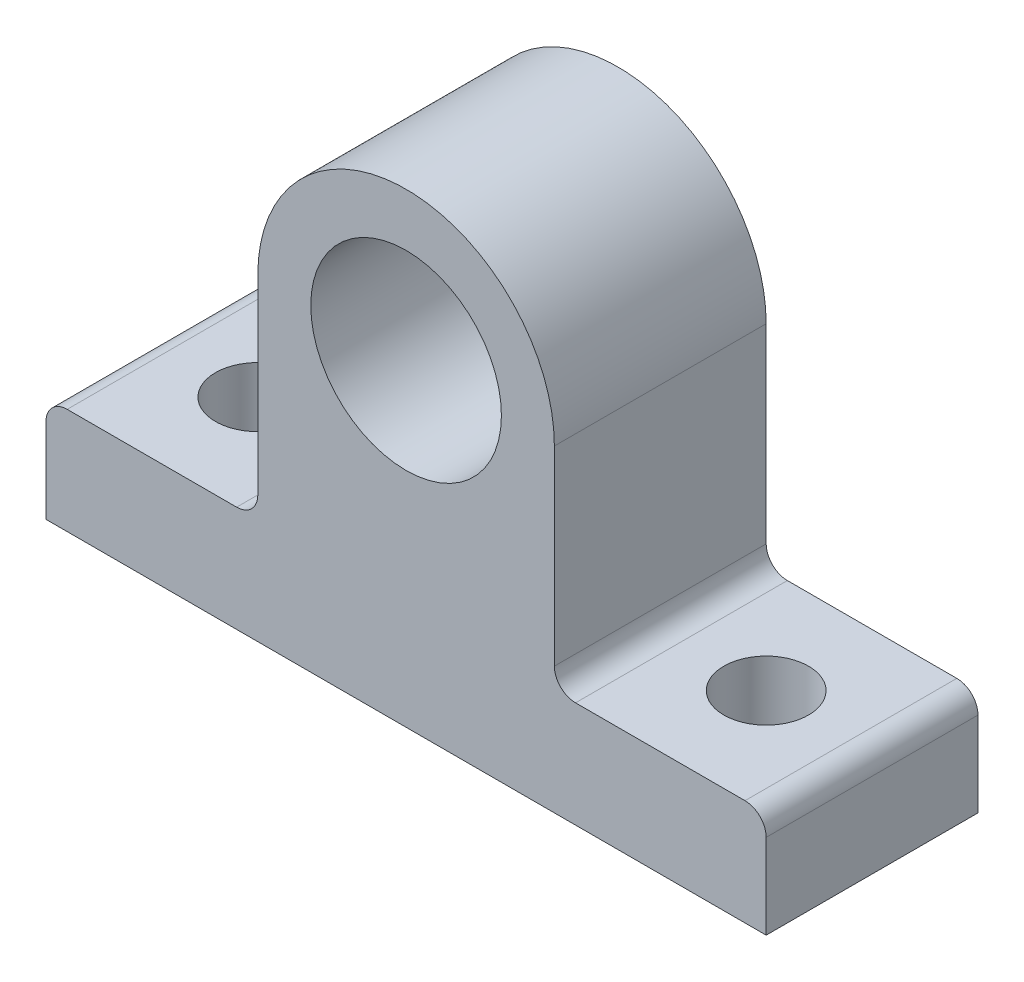
ISO-10303-21;
HEADER;
FILE_DESCRIPTION(('STEP AP214'),'2;1');
FILE_NAME('part.step','',(''),(''),'','','');
FILE_SCHEMA(('AUTOMOTIVE_DESIGN { 1 0 10303 214 1 1 1 1 }'));
ENDSEC;
DATA;
#1=APPLICATION_CONTEXT('core data for automotive mechanical design processes');
#2=APPLICATION_PROTOCOL_DEFINITION('international standard','automotive_design',2000,#1);
#3=PRODUCT_CONTEXT('',#1,'mechanical');
#4=PRODUCT('Part','Part','',(#3));
#5=PRODUCT_RELATED_PRODUCT_CATEGORY('part','',(#4));
#6=PRODUCT_DEFINITION_FORMATION('','',#4);
#7=PRODUCT_DEFINITION_CONTEXT('part definition',#1,'design');
#8=PRODUCT_DEFINITION('design','',#6,#7);
#9=PRODUCT_DEFINITION_SHAPE('','',#8);
#10=(LENGTH_UNIT() NAMED_UNIT(*) SI_UNIT(.MILLI.,.METRE.));
#11=(NAMED_UNIT(*) PLANE_ANGLE_UNIT() SI_UNIT($,.RADIAN.));
#12=(NAMED_UNIT(*) SI_UNIT($,.STERADIAN.) SOLID_ANGLE_UNIT());
#13=UNCERTAINTY_MEASURE_WITH_UNIT(LENGTH_MEASURE(1.E-05),#10,'distance_accuracy_value','');
#14=(GEOMETRIC_REPRESENTATION_CONTEXT(3) GLOBAL_UNCERTAINTY_ASSIGNED_CONTEXT((#13)) GLOBAL_UNIT_ASSIGNED_CONTEXT((#10,
#11,#12)) REPRESENTATION_CONTEXT('',''));
#15=CARTESIAN_POINT('',(0.,0.,0.));
#16=DIRECTION('',(0.,0.,1.));
#17=DIRECTION('',(1.,0.,0.));
#18=AXIS2_PLACEMENT_3D('',#15,#16,#17);
#19=CARTESIAN_POINT('',(17.,0.,10.));
#20=DIRECTION('',(-1.,0.,0.));
#21=DIRECTION('',(0.,-1.,0.));
#22=AXIS2_PLACEMENT_3D('',#19,#20,#21);
#23=PLANE('',#22);
#24=DIRECTION('',(0.,1.,0.));
#25=VECTOR('',#24,1.);
#26=CARTESIAN_POINT('',(17.,0.,0.));
#27=LINE('',#26,#25);
#28=CARTESIAN_POINT('',(17.,-15.,0.));
#29=VERTEX_POINT('',#28);
#30=CARTESIAN_POINT('',(17.,-11.,0.));
#31=VERTEX_POINT('',#30);
#32=EDGE_CURVE('E175',#29,#31,#27,.T.);
#33=ORIENTED_EDGE('',*,*,#32,.T.);
#34=DIRECTION('',(0.,0.,-1.));
#35=VECTOR('',#34,1.);
#36=CARTESIAN_POINT('',(17.,-11.,10.));
#37=LINE('',#36,#35);
#38=CARTESIAN_POINT('',(17.,-11.,10.));
#39=VERTEX_POINT('',#38);
#40=EDGE_CURVE('E60',#31,#39,#37,.F.);
#41=ORIENTED_EDGE('',*,*,#40,.T.);
#42=DIRECTION('',(0.,1.,0.));
#43=VECTOR('',#42,1.);
#44=CARTESIAN_POINT('',(17.,0.,10.));
#45=LINE('',#44,#43);
#46=CARTESIAN_POINT('',(17.,-15.,10.));
#47=VERTEX_POINT('',#46);
#48=EDGE_CURVE('E159',#47,#39,#45,.T.);
#49=ORIENTED_EDGE('',*,*,#48,.F.);
#50=DIRECTION('',(0.,0.,-1.));
#51=VECTOR('',#50,1.);
#52=CARTESIAN_POINT('',(17.,-15.,10.));
#53=LINE('',#52,#51);
#54=EDGE_CURVE('E174',#47,#29,#53,.T.);
#55=ORIENTED_EDGE('',*,*,#54,.T.);
#56=EDGE_LOOP('',(#33,#41,#49,#55));
#57=FACE_BOUND('',#56,.T.);
#58=ADVANCED_FACE('F37',(#57),#23,.F.);
#59=CARTESIAN_POINT('',(0.,-10.,10.));
#60=DIRECTION('',(0.,-1.,0.));
#61=DIRECTION('',(0.,0.,-1.));
#62=AXIS2_PLACEMENT_3D('',#59,#60,#61);
#63=PLANE('',#62);
#64=CARTESIAN_POINT('',(12.,-10.,5.));
#65=DIRECTION('',(0.,1.,0.));
#66=DIRECTION('',(0.,0.,1.));
#67=AXIS2_PLACEMENT_3D('',#64,#65,#66);
#68=CIRCLE('',#67,2.);
#69=CARTESIAN_POINT('',(12.,-10.,7.));
#70=VERTEX_POINT('',#69);
#71=EDGE_CURVE('E259',#70,#70,#68,.T.);
#72=ORIENTED_EDGE('',*,*,#71,.F.);
#73=EDGE_LOOP('',(#72));
#74=FACE_BOUND('',#73,.T.);
#75=DIRECTION('',(-1.,0.,0.));
#76=VECTOR('',#75,1.);
#77=CARTESIAN_POINT('',(0.,-10.,0.));
#78=LINE('',#77,#76);
#79=CARTESIAN_POINT('',(16.,-10.,0.));
#80=VERTEX_POINT('',#79);
#81=CARTESIAN_POINT('',(8.,-10.,0.));
#82=VERTEX_POINT('',#81);
#83=EDGE_CURVE('E177',#80,#82,#78,.T.);
#84=ORIENTED_EDGE('',*,*,#83,.T.);
#85=DIRECTION('',(0.,0.,-1.));
#86=VECTOR('',#85,1.);
#87=CARTESIAN_POINT('',(8.,-10.,10.));
#88=LINE('',#87,#86);
#89=CARTESIAN_POINT('',(8.,-10.,10.));
#90=VERTEX_POINT('',#89);
#91=EDGE_CURVE('E206',#82,#90,#88,.F.);
#92=ORIENTED_EDGE('',*,*,#91,.T.);
#93=DIRECTION('',(-1.,0.,0.));
#94=VECTOR('',#93,1.);
#95=CARTESIAN_POINT('',(0.,-10.,10.));
#96=LINE('',#95,#94);
#97=CARTESIAN_POINT('',(16.,-10.,10.));
#98=VERTEX_POINT('',#97);
#99=EDGE_CURVE('E157',#98,#90,#96,.T.);
#100=ORIENTED_EDGE('',*,*,#99,.F.);
#101=DIRECTION('',(0.,0.,-1.));
#102=VECTOR('',#101,1.);
#103=CARTESIAN_POINT('',(16.,-10.,10.));
#104=LINE('',#103,#102);
#105=EDGE_CURVE('E203',#98,#80,#104,.T.);
#106=ORIENTED_EDGE('',*,*,#105,.T.);
#107=EDGE_LOOP('',(#84,#92,#100,#106));
#108=FACE_BOUND('',#107,.T.);
#109=ADVANCED_FACE('F281',(#74,#108),#63,.F.);
#110=CARTESIAN_POINT('',(7.,0.,10.));
#111=DIRECTION('',(1.,0.,0.));
#112=DIRECTION('',(0.,1.,0.));
#113=AXIS2_PLACEMENT_3D('',#110,#111,#112);
#114=PLANE('',#113);
#115=DIRECTION('',(0.,-1.,0.));
#116=VECTOR('',#115,1.);
#117=CARTESIAN_POINT('',(7.,0.,10.));
#118=LINE('',#117,#116);
#119=CARTESIAN_POINT('',(7.,0.,10.));
#120=VERTEX_POINT('',#119);
#121=CARTESIAN_POINT('',(7.,-9.,10.));
#122=VERTEX_POINT('',#121);
#123=EDGE_CURVE('E134',#120,#122,#118,.T.);
#124=ORIENTED_EDGE('',*,*,#123,.T.);
#125=DIRECTION('',(0.,0.,-1.));
#126=VECTOR('',#125,1.);
#127=CARTESIAN_POINT('',(7.,-9.,10.));
#128=LINE('',#127,#126);
#129=CARTESIAN_POINT('',(7.,-9.,0.));
#130=VERTEX_POINT('',#129);
#131=EDGE_CURVE('E141',#122,#130,#128,.T.);
#132=ORIENTED_EDGE('',*,*,#131,.T.);
#133=DIRECTION('',(0.,-1.,0.));
#134=VECTOR('',#133,1.);
#135=CARTESIAN_POINT('',(7.,0.,0.));
#136=LINE('',#135,#134);
#137=CARTESIAN_POINT('',(7.,0.,0.));
#138=VERTEX_POINT('',#137);
#139=EDGE_CURVE('E137',#138,#130,#136,.T.);
#140=ORIENTED_EDGE('',*,*,#139,.F.);
#141=DIRECTION('',(0.,0.,-1.));
#142=VECTOR('',#141,1.);
#143=CARTESIAN_POINT('',(7.,0.,10.));
#144=LINE('',#143,#142);
#145=EDGE_CURVE('E129',#120,#138,#144,.T.);
#146=ORIENTED_EDGE('',*,*,#145,.F.);
#147=EDGE_LOOP('',(#124,#132,#140,#146));
#148=FACE_BOUND('',#147,.T.);
#149=ADVANCED_FACE('F131',(#148),#114,.T.);
#150=CARTESIAN_POINT('',(0.,0.,10.));
#151=DIRECTION('',(0.,0.,-1.));
#152=DIRECTION('',(-1.,0.,0.));
#153=AXIS2_PLACEMENT_3D('',#150,#151,#152);
#154=CYLINDRICAL_SURFACE('',#153,7.);
#155=CARTESIAN_POINT('',(0.,0.,0.));
#156=DIRECTION('',(0.,0.,1.));
#157=DIRECTION('',(1.,0.,0.));
#158=AXIS2_PLACEMENT_3D('',#155,#156,#157);
#159=CIRCLE('',#158,7.);
#160=CARTESIAN_POINT('',(-7.,0.,0.));
#161=VERTEX_POINT('',#160);
#162=EDGE_CURVE('E182',#138,#161,#159,.T.);
#163=ORIENTED_EDGE('',*,*,#162,.T.);
#164=DIRECTION('',(0.,0.,-1.));
#165=VECTOR('',#164,1.);
#166=CARTESIAN_POINT('',(-7.,0.,10.));
#167=LINE('',#166,#165);
#168=CARTESIAN_POINT('',(-7.,0.,10.));
#169=VERTEX_POINT('',#168);
#170=EDGE_CURVE('E142',#169,#161,#167,.T.);
#171=ORIENTED_EDGE('',*,*,#170,.F.);
#172=CARTESIAN_POINT('',(0.,0.,10.));
#173=DIRECTION('',(0.,0.,1.));
#174=DIRECTION('',(1.,0.,0.));
#175=AXIS2_PLACEMENT_3D('',#172,#173,#174);
#176=CIRCLE('',#175,7.);
#177=EDGE_CURVE('E146',#120,#169,#176,.T.);
#178=ORIENTED_EDGE('',*,*,#177,.F.);
#179=ORIENTED_EDGE('',*,*,#145,.T.);
#180=EDGE_LOOP('',(#163,#171,#178,#179));
#181=FACE_BOUND('',#180,.T.);
#182=ADVANCED_FACE('F147',(#181),#154,.T.);
#183=CARTESIAN_POINT('',(-7.,0.,10.));
#184=DIRECTION('',(-1.,0.,0.));
#185=DIRECTION('',(0.,-1.,0.));
#186=AXIS2_PLACEMENT_3D('',#183,#184,#185);
#187=PLANE('',#186);
#188=DIRECTION('',(0.,1.,0.));
#189=VECTOR('',#188,1.);
#190=CARTESIAN_POINT('',(-7.,0.,0.));
#191=LINE('',#190,#189);
#192=CARTESIAN_POINT('',(-7.,-9.,0.));
#193=VERTEX_POINT('',#192);
#194=EDGE_CURVE('E184',#193,#161,#191,.T.);
#195=ORIENTED_EDGE('',*,*,#194,.F.);
#196=DIRECTION('',(0.,0.,-1.));
#197=VECTOR('',#196,1.);
#198=CARTESIAN_POINT('',(-7.,-9.,10.));
#199=LINE('',#198,#197);
#200=CARTESIAN_POINT('',(-7.,-9.,10.));
#201=VERTEX_POINT('',#200);
#202=EDGE_CURVE('E213',#193,#201,#199,.F.);
#203=ORIENTED_EDGE('',*,*,#202,.T.);
#204=DIRECTION('',(0.,1.,0.));
#205=VECTOR('',#204,1.);
#206=CARTESIAN_POINT('',(-7.,0.,10.));
#207=LINE('',#206,#205);
#208=EDGE_CURVE('E150',#201,#169,#207,.T.);
#209=ORIENTED_EDGE('',*,*,#208,.T.);
#210=ORIENTED_EDGE('',*,*,#170,.T.);
#211=EDGE_LOOP('',(#195,#203,#209,#210));
#212=FACE_BOUND('',#211,.T.);
#213=ADVANCED_FACE('F238',(#212),#187,.T.);
#214=CARTESIAN_POINT('',(0.,-10.,10.));
#215=DIRECTION('',(0.,1.,0.));
#216=DIRECTION('',(-1.,0.,0.));
#217=AXIS2_PLACEMENT_3D('',#214,#215,#216);
#218=PLANE('',#217);
#219=CARTESIAN_POINT('',(-12.,-10.,5.));
#220=DIRECTION('',(0.,1.,0.));
#221=DIRECTION('',(0.,0.,-1.));
#222=AXIS2_PLACEMENT_3D('',#219,#220,#221);
#223=CIRCLE('',#222,2.);
#224=CARTESIAN_POINT('',(-12.,-10.,3.));
#225=VERTEX_POINT('',#224);
#226=EDGE_CURVE('E265',#225,#225,#223,.T.);
#227=ORIENTED_EDGE('',*,*,#226,.F.);
#228=EDGE_LOOP('',(#227));
#229=FACE_BOUND('',#228,.T.);
#230=DIRECTION('',(1.,0.,0.));
#231=VECTOR('',#230,1.);
#232=CARTESIAN_POINT('',(0.,-10.,10.));
#233=LINE('',#232,#231);
#234=CARTESIAN_POINT('',(-16.,-10.,10.));
#235=VERTEX_POINT('',#234);
#236=CARTESIAN_POINT('',(-8.,-10.,10.));
#237=VERTEX_POINT('',#236);
#238=EDGE_CURVE('E164',#235,#237,#233,.T.);
#239=ORIENTED_EDGE('',*,*,#238,.T.);
#240=DIRECTION('',(0.,0.,-1.));
#241=VECTOR('',#240,1.);
#242=CARTESIAN_POINT('',(-8.,-10.,0.));
#243=LINE('',#242,#241);
#244=CARTESIAN_POINT('',(-8.,-10.,0.));
#245=VERTEX_POINT('',#244);
#246=EDGE_CURVE('E210',#237,#245,#243,.T.);
#247=ORIENTED_EDGE('',*,*,#246,.T.);
#248=DIRECTION('',(1.,0.,0.));
#249=VECTOR('',#248,1.);
#250=CARTESIAN_POINT('',(0.,-10.,0.));
#251=LINE('',#250,#249);
#252=CARTESIAN_POINT('',(-16.,-10.,0.));
#253=VERTEX_POINT('',#252);
#254=EDGE_CURVE('E186',#253,#245,#251,.T.);
#255=ORIENTED_EDGE('',*,*,#254,.F.);
#256=DIRECTION('',(0.,0.,-1.));
#257=VECTOR('',#256,1.);
#258=CARTESIAN_POINT('',(-16.,-10.,10.));
#259=LINE('',#258,#257);
#260=EDGE_CURVE('E208',#253,#235,#259,.F.);
#261=ORIENTED_EDGE('',*,*,#260,.T.);
#262=EDGE_LOOP('',(#239,#247,#255,#261));
#263=FACE_BOUND('',#262,.T.);
#264=ADVANCED_FACE('F242',(#229,#263),#218,.T.);
#265=CARTESIAN_POINT('',(-17.,0.,10.));
#266=DIRECTION('',(-1.,0.,0.));
#267=DIRECTION('',(0.,-1.,0.));
#268=AXIS2_PLACEMENT_3D('',#265,#266,#267);
#269=PLANE('',#268);
#270=DIRECTION('',(0.,1.,0.));
#271=VECTOR('',#270,1.);
#272=CARTESIAN_POINT('',(-17.,0.,10.));
#273=LINE('',#272,#271);
#274=CARTESIAN_POINT('',(-17.,-15.,10.));
#275=VERTEX_POINT('',#274);
#276=CARTESIAN_POINT('',(-17.,-11.,10.));
#277=VERTEX_POINT('',#276);
#278=EDGE_CURVE('E167',#275,#277,#273,.T.);
#279=ORIENTED_EDGE('',*,*,#278,.T.);
#280=DIRECTION('',(0.,0.,-1.));
#281=VECTOR('',#280,1.);
#282=CARTESIAN_POINT('',(-17.,-11.,10.));
#283=LINE('',#282,#281);
#284=CARTESIAN_POINT('',(-17.,-11.,0.));
#285=VERTEX_POINT('',#284);
#286=EDGE_CURVE('E223',#277,#285,#283,.T.);
#287=ORIENTED_EDGE('',*,*,#286,.T.);
#288=DIRECTION('',(0.,1.,0.));
#289=VECTOR('',#288,1.);
#290=CARTESIAN_POINT('',(-17.,0.,0.));
#291=LINE('',#290,#289);
#292=CARTESIAN_POINT('',(-17.,-15.,0.));
#293=VERTEX_POINT('',#292);
#294=EDGE_CURVE('E189',#293,#285,#291,.T.);
#295=ORIENTED_EDGE('',*,*,#294,.F.);
#296=DIRECTION('',(0.,0.,-1.));
#297=VECTOR('',#296,1.);
#298=CARTESIAN_POINT('',(-17.,-15.,10.));
#299=LINE('',#298,#297);
#300=EDGE_CURVE('E199',#275,#293,#299,.T.);
#301=ORIENTED_EDGE('',*,*,#300,.F.);
#302=EDGE_LOOP('',(#279,#287,#295,#301));
#303=FACE_BOUND('',#302,.T.);
#304=ADVANCED_FACE('F248',(#303),#269,.T.);
#305=CARTESIAN_POINT('',(0.,-15.,10.));
#306=DIRECTION('',(0.,1.,0.));
#307=DIRECTION('',(-1.,0.,0.));
#308=AXIS2_PLACEMENT_3D('',#305,#306,#307);
#309=PLANE('',#308);
#310=CARTESIAN_POINT('',(-12.,-15.,5.));
#311=DIRECTION('',(0.,1.,0.));
#312=DIRECTION('',(-1.,0.,0.));
#313=AXIS2_PLACEMENT_3D('',#310,#311,#312);
#314=CIRCLE('',#313,2.);
#315=CARTESIAN_POINT('',(-14.,-15.,5.));
#316=VERTEX_POINT('',#315);
#317=EDGE_CURVE('E262',#316,#316,#314,.F.);
#318=ORIENTED_EDGE('',*,*,#317,.F.);
#319=EDGE_LOOP('',(#318));
#320=FACE_BOUND('',#319,.T.);
#321=CARTESIAN_POINT('',(12.,-15.,5.));
#322=DIRECTION('',(0.,1.,0.));
#323=DIRECTION('',(-1.,0.,0.));
#324=AXIS2_PLACEMENT_3D('',#321,#322,#323);
#325=CIRCLE('',#324,2.);
#326=CARTESIAN_POINT('',(10.,-15.,5.));
#327=VERTEX_POINT('',#326);
#328=EDGE_CURVE('E178',#327,#327,#325,.F.);
#329=ORIENTED_EDGE('',*,*,#328,.F.);
#330=EDGE_LOOP('',(#329));
#331=FACE_BOUND('',#330,.T.);
#332=DIRECTION('',(1.,0.,0.));
#333=VECTOR('',#332,1.);
#334=CARTESIAN_POINT('',(0.,-15.,0.));
#335=LINE('',#334,#333);
#336=EDGE_CURVE('E192',#293,#29,#335,.T.);
#337=ORIENTED_EDGE('',*,*,#336,.T.);
#338=ORIENTED_EDGE('',*,*,#54,.F.);
#339=DIRECTION('',(1.,0.,0.));
#340=VECTOR('',#339,1.);
#341=CARTESIAN_POINT('',(0.,-15.,10.));
#342=LINE('',#341,#340);
#343=EDGE_CURVE('E169',#275,#47,#342,.T.);
#344=ORIENTED_EDGE('',*,*,#343,.F.);
#345=ORIENTED_EDGE('',*,*,#300,.T.);
#346=EDGE_LOOP('',(#337,#338,#344,#345));
#347=FACE_BOUND('',#346,.T.);
#348=ADVANCED_FACE('F253',(#320,#331,#347),#309,.F.);
#349=CARTESIAN_POINT('',(0.,0.,10.));
#350=DIRECTION('',(0.,0.,-1.));
#351=DIRECTION('',(-1.,0.,0.));
#352=AXIS2_PLACEMENT_3D('',#349,#350,#351);
#353=CYLINDRICAL_SURFACE('',#352,4.5);
#354=CARTESIAN_POINT('',(0.,0.,10.));
#355=DIRECTION('',(0.,0.,1.));
#356=DIRECTION('',(1.,0.,0.));
#357=AXIS2_PLACEMENT_3D('',#354,#355,#356);
#358=CIRCLE('',#357,4.5);
#359=CARTESIAN_POINT('',(4.5,0.,10.));
#360=VERTEX_POINT('',#359);
#361=EDGE_CURVE('E171',#360,#360,#358,.T.);
#362=ORIENTED_EDGE('',*,*,#361,.T.);
#363=EDGE_LOOP('',(#362));
#364=FACE_BOUND('',#363,.T.);
#365=CARTESIAN_POINT('',(0.,0.,0.));
#366=DIRECTION('',(0.,0.,1.));
#367=DIRECTION('',(1.,0.,0.));
#368=AXIS2_PLACEMENT_3D('',#365,#366,#367);
#369=CIRCLE('',#368,4.5);
#370=CARTESIAN_POINT('',(4.5,0.,0.));
#371=VERTEX_POINT('',#370);
#372=EDGE_CURVE('E194',#371,#371,#369,.T.);
#373=ORIENTED_EDGE('',*,*,#372,.F.);
#374=EDGE_LOOP('',(#373));
#375=FACE_BOUND('',#374,.T.);
#376=ADVANCED_FACE('F346',(#364,#375),#353,.F.);
#377=CARTESIAN_POINT('',(0.,0.,10.));
#378=DIRECTION('',(0.,0.,1.));
#379=DIRECTION('',(1.,0.,0.));
#380=AXIS2_PLACEMENT_3D('',#377,#378,#379);
#381=PLANE('',#380);
#382=ORIENTED_EDGE('',*,*,#48,.T.);
#383=CARTESIAN_POINT('',(16.,-11.,10.));
#384=DIRECTION('',(0.,0.,1.));
#385=DIRECTION('',(1.,0.,0.));
#386=AXIS2_PLACEMENT_3D('',#383,#384,#385);
#387=CIRCLE('',#386,1.);
#388=EDGE_CURVE('E221',#39,#98,#387,.T.);
#389=ORIENTED_EDGE('',*,*,#388,.T.);
#390=ORIENTED_EDGE('',*,*,#99,.T.);
#391=CARTESIAN_POINT('',(8.,-9.,10.));
#392=DIRECTION('',(0.,0.,1.));
#393=DIRECTION('',(1.,0.,0.));
#394=AXIS2_PLACEMENT_3D('',#391,#392,#393);
#395=CIRCLE('',#394,1.);
#396=EDGE_CURVE('E156',#90,#122,#395,.F.);
#397=ORIENTED_EDGE('',*,*,#396,.T.);
#398=ORIENTED_EDGE('',*,*,#123,.F.);
#399=ORIENTED_EDGE('',*,*,#177,.T.);
#400=ORIENTED_EDGE('',*,*,#208,.F.);
#401=CARTESIAN_POINT('',(-8.,-9.,10.));
#402=DIRECTION('',(0.,0.,1.));
#403=DIRECTION('',(1.,0.,0.));
#404=AXIS2_PLACEMENT_3D('',#401,#402,#403);
#405=CIRCLE('',#404,1.);
#406=EDGE_CURVE('E11',#201,#237,#405,.F.);
#407=ORIENTED_EDGE('',*,*,#406,.T.);
#408=ORIENTED_EDGE('',*,*,#238,.F.);
#409=CARTESIAN_POINT('',(-16.,-11.,10.));
#410=DIRECTION('',(0.,0.,1.));
#411=DIRECTION('',(1.,0.,0.));
#412=AXIS2_PLACEMENT_3D('',#409,#410,#411);
#413=CIRCLE('',#412,1.);
#414=EDGE_CURVE('E52',#235,#277,#413,.T.);
#415=ORIENTED_EDGE('',*,*,#414,.T.);
#416=ORIENTED_EDGE('',*,*,#278,.F.);
#417=ORIENTED_EDGE('',*,*,#343,.T.);
#418=EDGE_LOOP('',(#382,#389,#390,#397,#398,#399,#400,#407,#408,#415,#416,#417));
#419=FACE_BOUND('',#418,.T.);
#420=ORIENTED_EDGE('',*,*,#361,.F.);
#421=EDGE_LOOP('',(#420));
#422=FACE_BOUND('',#421,.T.);
#423=ADVANCED_FACE('F152',(#419,#422),#381,.T.);
#424=CARTESIAN_POINT('',(0.,0.,0.));
#425=DIRECTION('',(0.,0.,1.));
#426=DIRECTION('',(1.,0.,0.));
#427=AXIS2_PLACEMENT_3D('',#424,#425,#426);
#428=PLANE('',#427);
#429=ORIENTED_EDGE('',*,*,#83,.F.);
#430=CARTESIAN_POINT('',(16.,-11.,0.));
#431=DIRECTION('',(0.,0.,1.));
#432=DIRECTION('',(1.,0.,0.));
#433=AXIS2_PLACEMENT_3D('',#430,#431,#432);
#434=CIRCLE('',#433,1.);
#435=EDGE_CURVE('E217',#80,#31,#434,.F.);
#436=ORIENTED_EDGE('',*,*,#435,.T.);
#437=ORIENTED_EDGE('',*,*,#32,.F.);
#438=ORIENTED_EDGE('',*,*,#336,.F.);
#439=ORIENTED_EDGE('',*,*,#294,.T.);
#440=CARTESIAN_POINT('',(-16.,-11.,0.));
#441=DIRECTION('',(0.,0.,1.));
#442=DIRECTION('',(1.,0.,0.));
#443=AXIS2_PLACEMENT_3D('',#440,#441,#442);
#444=CIRCLE('',#443,1.);
#445=EDGE_CURVE('E215',#285,#253,#444,.F.);
#446=ORIENTED_EDGE('',*,*,#445,.T.);
#447=ORIENTED_EDGE('',*,*,#254,.T.);
#448=CARTESIAN_POINT('',(-8.,-9.,0.));
#449=DIRECTION('',(0.,0.,1.));
#450=DIRECTION('',(1.,0.,0.));
#451=AXIS2_PLACEMENT_3D('',#448,#449,#450);
#452=CIRCLE('',#451,1.);
#453=EDGE_CURVE('E45',#245,#193,#452,.T.);
#454=ORIENTED_EDGE('',*,*,#453,.T.);
#455=ORIENTED_EDGE('',*,*,#194,.T.);
#456=ORIENTED_EDGE('',*,*,#162,.F.);
#457=ORIENTED_EDGE('',*,*,#139,.T.);
#458=CARTESIAN_POINT('',(8.,-9.,0.));
#459=DIRECTION('',(0.,0.,1.));
#460=DIRECTION('',(1.,0.,0.));
#461=AXIS2_PLACEMENT_3D('',#458,#459,#460);
#462=CIRCLE('',#461,1.);
#463=EDGE_CURVE('E226',#130,#82,#462,.T.);
#464=ORIENTED_EDGE('',*,*,#463,.T.);
#465=EDGE_LOOP('',(#429,#436,#437,#438,#439,#446,#447,#454,#455,#456,#457,#464));
#466=FACE_BOUND('',#465,.T.);
#467=ORIENTED_EDGE('',*,*,#372,.T.);
#468=EDGE_LOOP('',(#467));
#469=FACE_BOUND('',#468,.T.);
#470=ADVANCED_FACE('F231',(#466,#469),#428,.F.);
#471=CARTESIAN_POINT('',(12.,-15.001,5.));
#472=DIRECTION('',(0.,1.,0.));
#473=DIRECTION('',(0.,0.,1.));
#474=AXIS2_PLACEMENT_3D('',#471,#472,#473);
#475=CYLINDRICAL_SURFACE('',#474,2.);
#476=ORIENTED_EDGE('',*,*,#71,.T.);
#477=EDGE_LOOP('',(#476));
#478=FACE_BOUND('',#477,.T.);
#479=ORIENTED_EDGE('',*,*,#328,.T.);
#480=EDGE_LOOP('',(#479));
#481=FACE_BOUND('',#480,.T.);
#482=ADVANCED_FACE('F334',(#478,#481),#475,.F.);
#483=CARTESIAN_POINT('',(-12.,-15.001,5.));
#484=DIRECTION('',(0.,1.,0.));
#485=DIRECTION('',(0.,0.,1.));
#486=AXIS2_PLACEMENT_3D('',#483,#484,#485);
#487=CYLINDRICAL_SURFACE('',#486,2.);
#488=ORIENTED_EDGE('',*,*,#226,.T.);
#489=EDGE_LOOP('',(#488));
#490=FACE_BOUND('',#489,.T.);
#491=ORIENTED_EDGE('',*,*,#317,.T.);
#492=EDGE_LOOP('',(#491));
#493=FACE_BOUND('',#492,.T.);
#494=ADVANCED_FACE('F269',(#490,#493),#487,.F.);
#495=CARTESIAN_POINT('',(8.,-9.,10.));
#496=DIRECTION('',(0.,0.,-1.));
#497=DIRECTION('',(-1.,0.,0.));
#498=AXIS2_PLACEMENT_3D('',#495,#496,#497);
#499=CYLINDRICAL_SURFACE('',#498,1.);
#500=ORIENTED_EDGE('',*,*,#396,.F.);
#501=ORIENTED_EDGE('',*,*,#91,.F.);
#502=ORIENTED_EDGE('',*,*,#463,.F.);
#503=ORIENTED_EDGE('',*,*,#131,.F.);
#504=EDGE_LOOP('',(#500,#501,#502,#503));
#505=FACE_BOUND('',#504,.T.);
#506=ADVANCED_FACE('F290',(#505),#499,.F.);
#507=CARTESIAN_POINT('',(-8.,-9.,10.));
#508=DIRECTION('',(0.,0.,1.));
#509=DIRECTION('',(1.,0.,0.));
#510=AXIS2_PLACEMENT_3D('',#507,#508,#509);
#511=CYLINDRICAL_SURFACE('',#510,1.);
#512=ORIENTED_EDGE('',*,*,#406,.F.);
#513=ORIENTED_EDGE('',*,*,#202,.F.);
#514=ORIENTED_EDGE('',*,*,#453,.F.);
#515=ORIENTED_EDGE('',*,*,#246,.F.);
#516=EDGE_LOOP('',(#512,#513,#514,#515));
#517=FACE_BOUND('',#516,.T.);
#518=ADVANCED_FACE('F240',(#517),#511,.F.);
#519=CARTESIAN_POINT('',(16.,-11.,10.));
#520=DIRECTION('',(0.,0.,-1.));
#521=DIRECTION('',(-1.,0.,0.));
#522=AXIS2_PLACEMENT_3D('',#519,#520,#521);
#523=CYLINDRICAL_SURFACE('',#522,1.);
#524=ORIENTED_EDGE('',*,*,#388,.F.);
#525=ORIENTED_EDGE('',*,*,#40,.F.);
#526=ORIENTED_EDGE('',*,*,#435,.F.);
#527=ORIENTED_EDGE('',*,*,#105,.F.);
#528=EDGE_LOOP('',(#524,#525,#526,#527));
#529=FACE_BOUND('',#528,.T.);
#530=ADVANCED_FACE('F295',(#529),#523,.T.);
#531=CARTESIAN_POINT('',(-16.,-11.,10.));
#532=DIRECTION('',(0.,0.,-1.));
#533=DIRECTION('',(-1.,0.,0.));
#534=AXIS2_PLACEMENT_3D('',#531,#532,#533);
#535=CYLINDRICAL_SURFACE('',#534,1.);
#536=ORIENTED_EDGE('',*,*,#414,.F.);
#537=ORIENTED_EDGE('',*,*,#260,.F.);
#538=ORIENTED_EDGE('',*,*,#445,.F.);
#539=ORIENTED_EDGE('',*,*,#286,.F.);
#540=EDGE_LOOP('',(#536,#537,#538,#539));
#541=FACE_BOUND('',#540,.T.);
#542=ADVANCED_FACE('F39',(#541),#535,.T.);
#543=CLOSED_SHELL('',(#58,#109,#149,#182,#213,#264,#304,#348,#376,#423,#470,#482,#494,#506,#518,
#530,#542));
#544=MANIFOLD_SOLID_BREP('B2',#543);
#545=ADVANCED_BREP_SHAPE_REPRESENTATION('',(#18,#544),#14);
#546=SHAPE_DEFINITION_REPRESENTATION(#9,#545);
ENDSEC;
END-ISO-10303-21;
